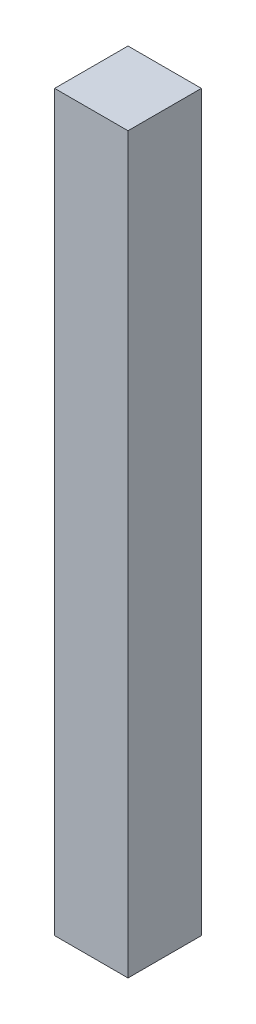
ISO-10303-21;
HEADER;
FILE_DESCRIPTION(('STEP AP214'),'2;1');
FILE_NAME('part.step','',(''),(''),'','','');
FILE_SCHEMA(('AUTOMOTIVE_DESIGN { 1 0 10303 214 1 1 1 1 }'));
ENDSEC;
DATA;
#1=APPLICATION_CONTEXT('core data for automotive mechanical design processes');
#2=APPLICATION_PROTOCOL_DEFINITION('international standard','automotive_design',2000,#1);
#3=PRODUCT_CONTEXT('',#1,'mechanical');
#4=PRODUCT('Part','Part','',(#3));
#5=PRODUCT_RELATED_PRODUCT_CATEGORY('part','',(#4));
#6=PRODUCT_DEFINITION_FORMATION('','',#4);
#7=PRODUCT_DEFINITION_CONTEXT('part definition',#1,'design');
#8=PRODUCT_DEFINITION('design','',#6,#7);
#9=PRODUCT_DEFINITION_SHAPE('','',#8);
#10=(LENGTH_UNIT() NAMED_UNIT(*) SI_UNIT(.MILLI.,.METRE.));
#11=(NAMED_UNIT(*) PLANE_ANGLE_UNIT() SI_UNIT($,.RADIAN.));
#12=(NAMED_UNIT(*) SI_UNIT($,.STERADIAN.) SOLID_ANGLE_UNIT());
#13=UNCERTAINTY_MEASURE_WITH_UNIT(LENGTH_MEASURE(1.E-05),#10,'distance_accuracy_value','');
#14=(GEOMETRIC_REPRESENTATION_CONTEXT(3) GLOBAL_UNCERTAINTY_ASSIGNED_CONTEXT((#13)) GLOBAL_UNIT_ASSIGNED_CONTEXT((#10,
#11,#12)) REPRESENTATION_CONTEXT('',''));
#15=CARTESIAN_POINT('',(0.,0.,0.));
#16=DIRECTION('',(0.,0.,1.));
#17=DIRECTION('',(1.,0.,0.));
#18=AXIS2_PLACEMENT_3D('',#15,#16,#17);
#19=CARTESIAN_POINT('',(-50.,500.,-29.0760869565217));
#20=DIRECTION('',(1.,0.,0.));
#21=DIRECTION('',(0.,0.,-1.));
#22=AXIS2_PLACEMENT_3D('',#19,#20,#21);
#23=PLANE('',#22);
#24=DIRECTION('',(0.,0.,1.));
#25=VECTOR('',#24,1.);
#26=CARTESIAN_POINT('',(-50.,0.,-29.0760869565217));
#27=LINE('',#26,#25);
#28=CARTESIAN_POINT('',(-50.,0.,-29.0760869565217));
#29=VERTEX_POINT('',#28);
#30=CARTESIAN_POINT('',(-50.,0.,20.9239130434783));
#31=VERTEX_POINT('',#30);
#32=EDGE_CURVE('E99',#29,#31,#27,.T.);
#33=ORIENTED_EDGE('',*,*,#32,.T.);
#34=DIRECTION('',(0.,-1.,0.));
#35=VECTOR('',#34,1.);
#36=CARTESIAN_POINT('',(-50.,500.,20.9239130434783));
#37=LINE('',#36,#35);
#38=CARTESIAN_POINT('',(-50.,500.,20.9239130434783));
#39=VERTEX_POINT('',#38);
#40=EDGE_CURVE('E11',#39,#31,#37,.T.);
#41=ORIENTED_EDGE('',*,*,#40,.F.);
#42=DIRECTION('',(0.,0.,1.));
#43=VECTOR('',#42,1.);
#44=CARTESIAN_POINT('',(-50.,500.,-29.0760869565217));
#45=LINE('',#44,#43);
#46=CARTESIAN_POINT('',(-50.,500.,-29.0760869565217));
#47=VERTEX_POINT('',#46);
#48=EDGE_CURVE('E85',#47,#39,#45,.T.);
#49=ORIENTED_EDGE('',*,*,#48,.F.);
#50=DIRECTION('',(0.,-1.,0.));
#51=VECTOR('',#50,1.);
#52=CARTESIAN_POINT('',(-50.,500.,-29.0760869565217));
#53=LINE('',#52,#51);
#54=EDGE_CURVE('E52',#47,#29,#53,.T.);
#55=ORIENTED_EDGE('',*,*,#54,.T.);
#56=EDGE_LOOP('',(#33,#41,#49,#55));
#57=FACE_BOUND('',#56,.T.);
#58=ADVANCED_FACE('F36',(#57),#23,.F.);
#59=CARTESIAN_POINT('',(-50.,500.,20.9239130434783));
#60=DIRECTION('',(0.,0.,-1.));
#61=DIRECTION('',(-1.,0.,0.));
#62=AXIS2_PLACEMENT_3D('',#59,#60,#61);
#63=PLANE('',#62);
#64=DIRECTION('',(1.,0.,0.));
#65=VECTOR('',#64,1.);
#66=CARTESIAN_POINT('',(-50.,0.,20.9239130434783));
#67=LINE('',#66,#65);
#68=CARTESIAN_POINT('',(0.,0.,20.9239130434783));
#69=VERTEX_POINT('',#68);
#70=EDGE_CURVE('E90',#31,#69,#67,.T.);
#71=ORIENTED_EDGE('',*,*,#70,.T.);
#72=DIRECTION('',(0.,-1.,0.));
#73=VECTOR('',#72,1.);
#74=CARTESIAN_POINT('',(0.,500.,20.9239130434783));
#75=LINE('',#74,#73);
#76=CARTESIAN_POINT('',(0.,500.,20.9239130434783));
#77=VERTEX_POINT('',#76);
#78=EDGE_CURVE('E44',#77,#69,#75,.T.);
#79=ORIENTED_EDGE('',*,*,#78,.F.);
#80=DIRECTION('',(1.,0.,0.));
#81=VECTOR('',#80,1.);
#82=CARTESIAN_POINT('',(-50.,500.,20.9239130434783));
#83=LINE('',#82,#81);
#84=EDGE_CURVE('E77',#39,#77,#83,.T.);
#85=ORIENTED_EDGE('',*,*,#84,.F.);
#86=ORIENTED_EDGE('',*,*,#40,.T.);
#87=EDGE_LOOP('',(#71,#79,#85,#86));
#88=FACE_BOUND('',#87,.T.);
#89=ADVANCED_FACE('F89',(#88),#63,.F.);
#90=CARTESIAN_POINT('',(0.,500.,-29.0760869565217));
#91=DIRECTION('',(1.,0.,0.));
#92=DIRECTION('',(0.,0.,-1.));
#93=AXIS2_PLACEMENT_3D('',#90,#91,#92);
#94=PLANE('',#93);
#95=DIRECTION('',(0.,0.,1.));
#96=VECTOR('',#95,1.);
#97=CARTESIAN_POINT('',(0.,0.,-29.0760869565217));
#98=LINE('',#97,#96);
#99=CARTESIAN_POINT('',(0.,0.,-29.0760869565217));
#100=VERTEX_POINT('',#99);
#101=EDGE_CURVE('E102',#100,#69,#98,.T.);
#102=ORIENTED_EDGE('',*,*,#101,.F.);
#103=DIRECTION('',(0.,-1.,0.));
#104=VECTOR('',#103,1.);
#105=CARTESIAN_POINT('',(0.,500.,-29.0760869565217));
#106=LINE('',#105,#104);
#107=CARTESIAN_POINT('',(0.,500.,-29.0760869565217));
#108=VERTEX_POINT('',#107);
#109=EDGE_CURVE('E66',#108,#100,#106,.T.);
#110=ORIENTED_EDGE('',*,*,#109,.F.);
#111=DIRECTION('',(0.,0.,1.));
#112=VECTOR('',#111,1.);
#113=CARTESIAN_POINT('',(0.,500.,-29.0760869565217));
#114=LINE('',#113,#112);
#115=EDGE_CURVE('E84',#108,#77,#114,.T.);
#116=ORIENTED_EDGE('',*,*,#115,.T.);
#117=ORIENTED_EDGE('',*,*,#78,.T.);
#118=EDGE_LOOP('',(#102,#110,#116,#117));
#119=FACE_BOUND('',#118,.T.);
#120=ADVANCED_FACE('F93',(#119),#94,.T.);
#121=CARTESIAN_POINT('',(-50.,500.,-29.0760869565217));
#122=DIRECTION('',(0.,0.,-1.));
#123=DIRECTION('',(-1.,0.,0.));
#124=AXIS2_PLACEMENT_3D('',#121,#122,#123);
#125=PLANE('',#124);
#126=DIRECTION('',(1.,0.,0.));
#127=VECTOR('',#126,1.);
#128=CARTESIAN_POINT('',(-50.,0.,-29.0760869565217));
#129=LINE('',#128,#127);
#130=EDGE_CURVE('E104',#29,#100,#129,.T.);
#131=ORIENTED_EDGE('',*,*,#130,.F.);
#132=ORIENTED_EDGE('',*,*,#54,.F.);
#133=DIRECTION('',(1.,0.,0.));
#134=VECTOR('',#133,1.);
#135=CARTESIAN_POINT('',(-50.,500.,-29.0760869565217));
#136=LINE('',#135,#134);
#137=EDGE_CURVE('E94',#47,#108,#136,.T.);
#138=ORIENTED_EDGE('',*,*,#137,.T.);
#139=ORIENTED_EDGE('',*,*,#109,.T.);
#140=EDGE_LOOP('',(#131,#132,#138,#139));
#141=FACE_BOUND('',#140,.T.);
#142=ADVANCED_FACE('F110',(#141),#125,.T.);
#143=CARTESIAN_POINT('',(0.,500.,0.));
#144=DIRECTION('',(0.,1.,0.));
#145=DIRECTION('',(0.,0.,1.));
#146=AXIS2_PLACEMENT_3D('',#143,#144,#145);
#147=PLANE('',#146);
#148=ORIENTED_EDGE('',*,*,#48,.T.);
#149=ORIENTED_EDGE('',*,*,#84,.T.);
#150=ORIENTED_EDGE('',*,*,#115,.F.);
#151=ORIENTED_EDGE('',*,*,#137,.F.);
#152=EDGE_LOOP('',(#148,#149,#150,#151));
#153=FACE_BOUND('',#152,.T.);
#154=ADVANCED_FACE('F81',(#153),#147,.T.);
#155=CARTESIAN_POINT('',(0.,0.,0.));
#156=DIRECTION('',(0.,1.,0.));
#157=DIRECTION('',(0.,0.,1.));
#158=AXIS2_PLACEMENT_3D('',#155,#156,#157);
#159=PLANE('',#158);
#160=ORIENTED_EDGE('',*,*,#32,.F.);
#161=ORIENTED_EDGE('',*,*,#130,.T.);
#162=ORIENTED_EDGE('',*,*,#101,.T.);
#163=ORIENTED_EDGE('',*,*,#70,.F.);
#164=EDGE_LOOP('',(#160,#161,#162,#163));
#165=FACE_BOUND('',#164,.T.);
#166=ADVANCED_FACE('F109',(#165),#159,.F.);
#167=CLOSED_SHELL('',(#58,#89,#120,#142,#154,#166));
#168=MANIFOLD_SOLID_BREP('B2',#167);
#169=ADVANCED_BREP_SHAPE_REPRESENTATION('',(#18,#168),#14);
#170=SHAPE_DEFINITION_REPRESENTATION(#9,#169);
ENDSEC;
END-ISO-10303-21;
